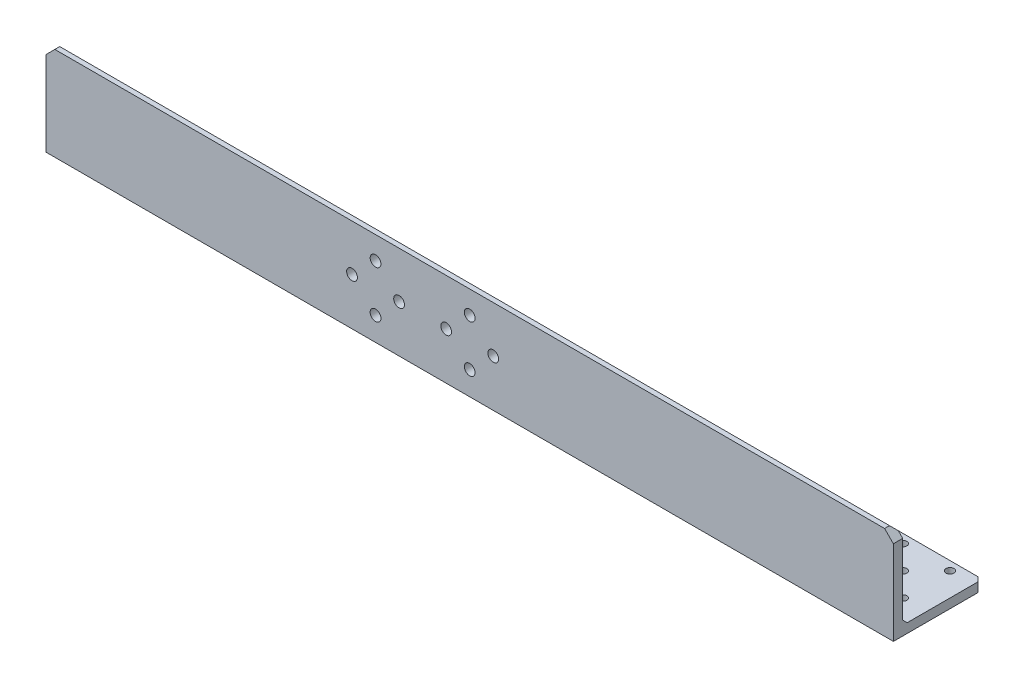
ISO-10303-21;
HEADER;
FILE_DESCRIPTION(('STEP AP214'),'2;1');
FILE_NAME('part.step','',(''),(''),'','','');
FILE_SCHEMA(('AUTOMOTIVE_DESIGN { 1 0 10303 214 1 1 1 1 }'));
ENDSEC;
DATA;
#1=APPLICATION_CONTEXT('core data for automotive mechanical design processes');
#2=APPLICATION_PROTOCOL_DEFINITION('international standard','automotive_design',2000,#1);
#3=PRODUCT_CONTEXT('',#1,'mechanical');
#4=PRODUCT('Part','Part','',(#3));
#5=PRODUCT_RELATED_PRODUCT_CATEGORY('part','',(#4));
#6=PRODUCT_DEFINITION_FORMATION('','',#4);
#7=PRODUCT_DEFINITION_CONTEXT('part definition',#1,'design');
#8=PRODUCT_DEFINITION('design','',#6,#7);
#9=PRODUCT_DEFINITION_SHAPE('','',#8);
#10=(LENGTH_UNIT() NAMED_UNIT(*) SI_UNIT(.MILLI.,.METRE.));
#11=(NAMED_UNIT(*) PLANE_ANGLE_UNIT() SI_UNIT($,.RADIAN.));
#12=(NAMED_UNIT(*) SI_UNIT($,.STERADIAN.) SOLID_ANGLE_UNIT());
#13=UNCERTAINTY_MEASURE_WITH_UNIT(LENGTH_MEASURE(1.E-05),#10,'distance_accuracy_value','');
#14=(GEOMETRIC_REPRESENTATION_CONTEXT(3) GLOBAL_UNCERTAINTY_ASSIGNED_CONTEXT((#13)) GLOBAL_UNIT_ASSIGNED_CONTEXT((#10,
#11,#12)) REPRESENTATION_CONTEXT('',''));
#15=CARTESIAN_POINT('',(0.,0.,0.));
#16=DIRECTION('',(0.,0.,1.));
#17=DIRECTION('',(1.,0.,0.));
#18=AXIS2_PLACEMENT_3D('',#15,#16,#17);
#19=CARTESIAN_POINT('',(144.,31.75,-3.175));
#20=DIRECTION('',(0.,0.,1.));
#21=DIRECTION('',(0.,-1.,0.));
#22=AXIS2_PLACEMENT_3D('',#19,#20,#21);
#23=PLANE('',#22);
#24=CARTESIAN_POINT('',(8.00000000000005,16.,-3.17500000000001));
#25=DIRECTION('',(0.,0.,-1.));
#26=DIRECTION('',(0.,1.,0.));
#27=AXIS2_PLACEMENT_3D('',#24,#25,#26);
#28=CIRCLE('',#27,1.8288);
#29=CARTESIAN_POINT('',(8.00000000000005,17.8288,-3.175));
#30=VERTEX_POINT('',#29);
#31=EDGE_CURVE('E435',#30,#30,#28,.T.);
#32=ORIENTED_EDGE('',*,*,#31,.F.);
#33=EDGE_LOOP('',(#32));
#34=FACE_BOUND('',#33,.T.);
#35=CARTESIAN_POINT('',(-7.99999999999996,16.,-3.17500000000001));
#36=DIRECTION('',(0.,0.,-1.));
#37=DIRECTION('',(0.,1.,0.));
#38=AXIS2_PLACEMENT_3D('',#35,#36,#37);
#39=CIRCLE('',#38,1.8288);
#40=CARTESIAN_POINT('',(-7.99999999999996,17.8288,-3.175));
#41=VERTEX_POINT('',#40);
#42=EDGE_CURVE('E429',#41,#41,#39,.T.);
#43=ORIENTED_EDGE('',*,*,#42,.F.);
#44=EDGE_LOOP('',(#43));
#45=FACE_BOUND('',#44,.T.);
#46=CARTESIAN_POINT('',(0.,7.99999999999999,-3.17500000000001));
#47=DIRECTION('',(0.,0.,-1.));
#48=DIRECTION('',(0.,1.,0.));
#49=AXIS2_PLACEMENT_3D('',#46,#47,#48);
#50=CIRCLE('',#49,1.8288);
#51=CARTESIAN_POINT('',(0.,9.82879999999999,-3.17500000000001));
#52=VERTEX_POINT('',#51);
#53=EDGE_CURVE('E423',#52,#52,#50,.T.);
#54=ORIENTED_EDGE('',*,*,#53,.F.);
#55=EDGE_LOOP('',(#54));
#56=FACE_BOUND('',#55,.T.);
#57=CARTESIAN_POINT('',(-24.,16.,-3.17500000000001));
#58=DIRECTION('',(0.,0.,-1.));
#59=DIRECTION('',(0.,1.,0.));
#60=AXIS2_PLACEMENT_3D('',#57,#58,#59);
#61=CIRCLE('',#60,1.8288);
#62=CARTESIAN_POINT('',(-24.,17.8288,-3.175));
#63=VERTEX_POINT('',#62);
#64=EDGE_CURVE('E417',#63,#63,#61,.T.);
#65=ORIENTED_EDGE('',*,*,#64,.F.);
#66=EDGE_LOOP('',(#65));
#67=FACE_BOUND('',#66,.T.);
#68=CARTESIAN_POINT('',(-32.,24.,-3.175));
#69=DIRECTION('',(0.,0.,-1.));
#70=DIRECTION('',(0.,1.,0.));
#71=AXIS2_PLACEMENT_3D('',#68,#69,#70);
#72=CIRCLE('',#71,1.8288);
#73=CARTESIAN_POINT('',(-32.,25.8288,-3.175));
#74=VERTEX_POINT('',#73);
#75=EDGE_CURVE('E411',#74,#74,#72,.T.);
#76=ORIENTED_EDGE('',*,*,#75,.F.);
#77=EDGE_LOOP('',(#76));
#78=FACE_BOUND('',#77,.T.);
#79=CARTESIAN_POINT('',(-40.,16.,-3.17500000000001));
#80=DIRECTION('',(0.,0.,-1.));
#81=DIRECTION('',(0.,1.,0.));
#82=AXIS2_PLACEMENT_3D('',#79,#80,#81);
#83=CIRCLE('',#82,1.8288);
#84=CARTESIAN_POINT('',(-40.,17.8288,-3.175));
#85=VERTEX_POINT('',#84);
#86=EDGE_CURVE('E405',#85,#85,#83,.T.);
#87=ORIENTED_EDGE('',*,*,#86,.F.);
#88=EDGE_LOOP('',(#87));
#89=FACE_BOUND('',#88,.T.);
#90=CARTESIAN_POINT('',(-32.,7.99999999999999,-3.17500000000001));
#91=DIRECTION('',(0.,0.,-1.));
#92=DIRECTION('',(0.,1.,0.));
#93=AXIS2_PLACEMENT_3D('',#90,#91,#92);
#94=CIRCLE('',#93,1.8288);
#95=CARTESIAN_POINT('',(-32.,9.82879999999999,-3.17500000000001));
#96=VERTEX_POINT('',#95);
#97=EDGE_CURVE('E399',#96,#96,#94,.T.);
#98=ORIENTED_EDGE('',*,*,#97,.F.);
#99=EDGE_LOOP('',(#98));
#100=FACE_BOUND('',#99,.T.);
#101=DIRECTION('',(0.,1.,0.));
#102=VECTOR('',#101,1.);
#103=CARTESIAN_POINT('',(-144.,31.75,-3.175));
#104=LINE('',#103,#102);
#105=CARTESIAN_POINT('',(-144.,4.67500000000004,-3.17500000000001));
#106=VERTEX_POINT('',#105);
#107=CARTESIAN_POINT('',(-144.,28.75,-3.175));
#108=VERTEX_POINT('',#107);
#109=EDGE_CURVE('E152',#106,#108,#104,.T.);
#110=ORIENTED_EDGE('',*,*,#109,.T.);
#111=DIRECTION('',(0.707106781186551,0.707106781186544,0.));
#112=VECTOR('',#111,1.);
#113=CARTESIAN_POINT('',(-141.,31.75,-3.175));
#114=LINE('',#113,#112);
#115=CARTESIAN_POINT('',(-142.5,30.25,-3.175));
#116=VERTEX_POINT('',#115);
#117=EDGE_CURVE('E210',#108,#116,#114,.T.);
#118=ORIENTED_EDGE('',*,*,#117,.T.);
#119=DIRECTION('',(1.,0.,0.));
#120=VECTOR('',#119,1.);
#121=CARTESIAN_POINT('',(144.,30.25,-3.175));
#122=LINE('',#121,#120);
#123=CARTESIAN_POINT('',(142.5,30.25,-3.175));
#124=VERTEX_POINT('',#123);
#125=EDGE_CURVE('E181',#116,#124,#122,.T.);
#126=ORIENTED_EDGE('',*,*,#125,.T.);
#127=DIRECTION('',(-0.707106781186548,0.707106781186548,0.));
#128=VECTOR('',#127,1.);
#129=CARTESIAN_POINT('',(144.,28.75,-3.175));
#130=LINE('',#129,#128);
#131=CARTESIAN_POINT('',(144.,28.75,-3.175));
#132=VERTEX_POINT('',#131);
#133=EDGE_CURVE('E208',#124,#132,#130,.F.);
#134=ORIENTED_EDGE('',*,*,#133,.T.);
#135=DIRECTION('',(0.,1.,0.));
#136=VECTOR('',#135,1.);
#137=CARTESIAN_POINT('',(144.,31.75,-3.175));
#138=LINE('',#137,#136);
#139=CARTESIAN_POINT('',(144.,4.67500000000004,-3.17500000000001));
#140=VERTEX_POINT('',#139);
#141=EDGE_CURVE('E250',#140,#132,#138,.T.);
#142=ORIENTED_EDGE('',*,*,#141,.F.);
#143=DIRECTION('',(-1.,0.,0.));
#144=VECTOR('',#143,1.);
#145=CARTESIAN_POINT('',(-144.,4.67500000000004,-3.17500000000001));
#146=LINE('',#145,#144);
#147=EDGE_CURVE('E184',#140,#106,#146,.T.);
#148=ORIENTED_EDGE('',*,*,#147,.T.);
#149=EDGE_LOOP('',(#110,#118,#126,#134,#142,#148));
#150=FACE_BOUND('',#149,.T.);
#151=CARTESIAN_POINT('',(0.,24.,-3.175));
#152=DIRECTION('',(0.,0.,-1.));
#153=DIRECTION('',(0.,1.,0.));
#154=AXIS2_PLACEMENT_3D('',#151,#152,#153);
#155=CIRCLE('',#154,1.8288);
#156=CARTESIAN_POINT('',(0.,25.8288,-3.175));
#157=VERTEX_POINT('',#156);
#158=EDGE_CURVE('E441',#157,#157,#155,.T.);
#159=ORIENTED_EDGE('',*,*,#158,.F.);
#160=EDGE_LOOP('',(#159));
#161=FACE_BOUND('',#160,.T.);
#162=ADVANCED_FACE('F48',(#34,#45,#56,#67,#78,#89,#100,#150,#161),#23,.F.);
#163=CARTESIAN_POINT('',(144.,0.,0.));
#164=DIRECTION('',(0.,0.,-1.));
#165=DIRECTION('',(-1.,0.,0.));
#166=AXIS2_PLACEMENT_3D('',#163,#164,#165);
#167=PLANE('',#166);
#168=CARTESIAN_POINT('',(0.,24.,0.));
#169=DIRECTION('',(0.,0.,-1.));
#170=DIRECTION('',(0.,1.,0.));
#171=AXIS2_PLACEMENT_3D('',#168,#169,#170);
#172=CIRCLE('',#171,1.8288);
#173=CARTESIAN_POINT('',(0.,25.8288,0.));
#174=VERTEX_POINT('',#173);
#175=EDGE_CURVE('E438',#174,#174,#172,.T.);
#176=ORIENTED_EDGE('',*,*,#175,.T.);
#177=EDGE_LOOP('',(#176));
#178=FACE_BOUND('',#177,.T.);
#179=CARTESIAN_POINT('',(8.00000000000005,16.,0.));
#180=DIRECTION('',(0.,0.,-1.));
#181=DIRECTION('',(0.,1.,0.));
#182=AXIS2_PLACEMENT_3D('',#179,#180,#181);
#183=CIRCLE('',#182,1.8288);
#184=CARTESIAN_POINT('',(8.00000000000005,17.8288,0.));
#185=VERTEX_POINT('',#184);
#186=EDGE_CURVE('E432',#185,#185,#183,.T.);
#187=ORIENTED_EDGE('',*,*,#186,.T.);
#188=EDGE_LOOP('',(#187));
#189=FACE_BOUND('',#188,.T.);
#190=CARTESIAN_POINT('',(-7.99999999999996,16.,0.));
#191=DIRECTION('',(0.,0.,-1.));
#192=DIRECTION('',(0.,1.,0.));
#193=AXIS2_PLACEMENT_3D('',#190,#191,#192);
#194=CIRCLE('',#193,1.8288);
#195=CARTESIAN_POINT('',(-7.99999999999996,17.8288,0.));
#196=VERTEX_POINT('',#195);
#197=EDGE_CURVE('E426',#196,#196,#194,.T.);
#198=ORIENTED_EDGE('',*,*,#197,.T.);
#199=EDGE_LOOP('',(#198));
#200=FACE_BOUND('',#199,.T.);
#201=CARTESIAN_POINT('',(0.,7.99999999999999,0.));
#202=DIRECTION('',(0.,0.,-1.));
#203=DIRECTION('',(0.,1.,0.));
#204=AXIS2_PLACEMENT_3D('',#201,#202,#203);
#205=CIRCLE('',#204,1.8288);
#206=CARTESIAN_POINT('',(0.,9.82879999999999,0.));
#207=VERTEX_POINT('',#206);
#208=EDGE_CURVE('E420',#207,#207,#205,.T.);
#209=ORIENTED_EDGE('',*,*,#208,.T.);
#210=EDGE_LOOP('',(#209));
#211=FACE_BOUND('',#210,.T.);
#212=CARTESIAN_POINT('',(-24.,16.,0.));
#213=DIRECTION('',(0.,0.,-1.));
#214=DIRECTION('',(0.,1.,0.));
#215=AXIS2_PLACEMENT_3D('',#212,#213,#214);
#216=CIRCLE('',#215,1.8288);
#217=CARTESIAN_POINT('',(-24.,17.8288,0.));
#218=VERTEX_POINT('',#217);
#219=EDGE_CURVE('E414',#218,#218,#216,.T.);
#220=ORIENTED_EDGE('',*,*,#219,.T.);
#221=EDGE_LOOP('',(#220));
#222=FACE_BOUND('',#221,.T.);
#223=CARTESIAN_POINT('',(-32.,24.,0.));
#224=DIRECTION('',(0.,0.,-1.));
#225=DIRECTION('',(0.,1.,0.));
#226=AXIS2_PLACEMENT_3D('',#223,#224,#225);
#227=CIRCLE('',#226,1.8288);
#228=CARTESIAN_POINT('',(-32.,25.8288,0.));
#229=VERTEX_POINT('',#228);
#230=EDGE_CURVE('E408',#229,#229,#227,.T.);
#231=ORIENTED_EDGE('',*,*,#230,.T.);
#232=EDGE_LOOP('',(#231));
#233=FACE_BOUND('',#232,.T.);
#234=CARTESIAN_POINT('',(-40.,16.,0.));
#235=DIRECTION('',(0.,0.,-1.));
#236=DIRECTION('',(0.,1.,0.));
#237=AXIS2_PLACEMENT_3D('',#234,#235,#236);
#238=CIRCLE('',#237,1.8288);
#239=CARTESIAN_POINT('',(-40.,17.8288,0.));
#240=VERTEX_POINT('',#239);
#241=EDGE_CURVE('E402',#240,#240,#238,.T.);
#242=ORIENTED_EDGE('',*,*,#241,.T.);
#243=EDGE_LOOP('',(#242));
#244=FACE_BOUND('',#243,.T.);
#245=CARTESIAN_POINT('',(-32.,7.99999999999999,0.));
#246=DIRECTION('',(0.,0.,-1.));
#247=DIRECTION('',(0.,1.,0.));
#248=AXIS2_PLACEMENT_3D('',#245,#246,#247);
#249=CIRCLE('',#248,1.8288);
#250=CARTESIAN_POINT('',(-32.,9.82879999999999,0.));
#251=VERTEX_POINT('',#250);
#252=EDGE_CURVE('E396',#251,#251,#249,.T.);
#253=ORIENTED_EDGE('',*,*,#252,.T.);
#254=EDGE_LOOP('',(#253));
#255=FACE_BOUND('',#254,.T.);
#256=DIRECTION('',(-1.,0.,0.));
#257=VECTOR('',#256,1.);
#258=CARTESIAN_POINT('',(144.,31.75,0.));
#259=LINE('',#258,#257);
#260=CARTESIAN_POINT('',(141.,31.75,0.));
#261=VERTEX_POINT('',#260);
#262=CARTESIAN_POINT('',(-141.,31.75,0.));
#263=VERTEX_POINT('',#262);
#264=EDGE_CURVE('E172',#261,#263,#259,.T.);
#265=ORIENTED_EDGE('',*,*,#264,.T.);
#266=DIRECTION('',(-0.707106781186551,-0.707106781186544,0.));
#267=VECTOR('',#266,1.);
#268=CARTESIAN_POINT('',(-141.,31.75,0.));
#269=LINE('',#268,#267);
#270=CARTESIAN_POINT('',(-144.,28.75,0.));
#271=VERTEX_POINT('',#270);
#272=EDGE_CURVE('E202',#263,#271,#269,.T.);
#273=ORIENTED_EDGE('',*,*,#272,.T.);
#274=DIRECTION('',(0.,-1.,0.));
#275=VECTOR('',#274,1.);
#276=CARTESIAN_POINT('',(-144.,0.,0.));
#277=LINE('',#276,#275);
#278=CARTESIAN_POINT('',(-144.,0.,0.));
#279=VERTEX_POINT('',#278);
#280=EDGE_CURVE('E163',#271,#279,#277,.T.);
#281=ORIENTED_EDGE('',*,*,#280,.T.);
#282=DIRECTION('',(-1.,0.,0.));
#283=VECTOR('',#282,1.);
#284=CARTESIAN_POINT('',(144.,0.,0.));
#285=LINE('',#284,#283);
#286=CARTESIAN_POINT('',(144.,0.,0.));
#287=VERTEX_POINT('',#286);
#288=EDGE_CURVE('E157',#287,#279,#285,.T.);
#289=ORIENTED_EDGE('',*,*,#288,.F.);
#290=DIRECTION('',(0.,-1.,0.));
#291=VECTOR('',#290,1.);
#292=CARTESIAN_POINT('',(144.,0.,0.));
#293=LINE('',#292,#291);
#294=CARTESIAN_POINT('',(144.,28.75,0.));
#295=VERTEX_POINT('',#294);
#296=EDGE_CURVE('E145',#295,#287,#293,.T.);
#297=ORIENTED_EDGE('',*,*,#296,.F.);
#298=DIRECTION('',(0.707106781186548,-0.707106781186548,0.));
#299=VECTOR('',#298,1.);
#300=CARTESIAN_POINT('',(144.,28.75,0.));
#301=LINE('',#300,#299);
#302=EDGE_CURVE('E200',#295,#261,#301,.F.);
#303=ORIENTED_EDGE('',*,*,#302,.T.);
#304=EDGE_LOOP('',(#265,#273,#281,#289,#297,#303));
#305=FACE_BOUND('',#304,.T.);
#306=ADVANCED_FACE('F161',(#178,#189,#200,#211,#222,#233,#244,#255,#305),#167,.F.);
#307=CARTESIAN_POINT('',(144.,0.,0.));
#308=DIRECTION('',(0.,1.,0.));
#309=DIRECTION('',(0.,0.,1.));
#310=AXIS2_PLACEMENT_3D('',#307,#308,#309);
#311=PLANE('',#310);
#312=CARTESIAN_POINT('',(-136.,0.,-27.221));
#313=DIRECTION('',(0.,1.,0.));
#314=DIRECTION('',(0.,0.,1.));
#315=AXIS2_PLACEMENT_3D('',#312,#313,#314);
#316=CIRCLE('',#315,1.35255000000001);
#317=CARTESIAN_POINT('',(-136.,0.,-25.86845));
#318=VERTEX_POINT('',#317);
#319=EDGE_CURVE('E319',#318,#318,#316,.T.);
#320=ORIENTED_EDGE('',*,*,#319,.T.);
#321=EDGE_LOOP('',(#320));
#322=FACE_BOUND('',#321,.T.);
#323=CARTESIAN_POINT('',(-120.,0.,-27.221));
#324=DIRECTION('',(0.,1.,0.));
#325=DIRECTION('',(0.,0.,1.));
#326=AXIS2_PLACEMENT_3D('',#323,#324,#325);
#327=CIRCLE('',#326,1.35254999999999);
#328=CARTESIAN_POINT('',(-120.,0.,-25.86845));
#329=VERTEX_POINT('',#328);
#330=EDGE_CURVE('E323',#329,#329,#327,.T.);
#331=ORIENTED_EDGE('',*,*,#330,.T.);
#332=EDGE_LOOP('',(#331));
#333=FACE_BOUND('',#332,.T.);
#334=CARTESIAN_POINT('',(-128.,0.,-19.221));
#335=DIRECTION('',(0.,1.,0.));
#336=DIRECTION('',(0.,0.,1.));
#337=AXIS2_PLACEMENT_3D('',#334,#335,#336);
#338=CIRCLE('',#337,1.35255000000001);
#339=CARTESIAN_POINT('',(-128.,0.,-17.86845));
#340=VERTEX_POINT('',#339);
#341=EDGE_CURVE('E327',#340,#340,#338,.T.);
#342=ORIENTED_EDGE('',*,*,#341,.T.);
#343=EDGE_LOOP('',(#342));
#344=FACE_BOUND('',#343,.T.);
#345=CARTESIAN_POINT('',(-136.,0.,-11.221));
#346=DIRECTION('',(0.,1.,0.));
#347=DIRECTION('',(0.,0.,1.));
#348=AXIS2_PLACEMENT_3D('',#345,#346,#347);
#349=CIRCLE('',#348,1.35255000000001);
#350=CARTESIAN_POINT('',(-136.,0.,-9.86844999999996));
#351=VERTEX_POINT('',#350);
#352=EDGE_CURVE('E331',#351,#351,#349,.T.);
#353=ORIENTED_EDGE('',*,*,#352,.T.);
#354=EDGE_LOOP('',(#353));
#355=FACE_BOUND('',#354,.T.);
#356=CARTESIAN_POINT('',(-120.,0.,-11.221));
#357=DIRECTION('',(0.,1.,0.));
#358=DIRECTION('',(0.,0.,1.));
#359=AXIS2_PLACEMENT_3D('',#356,#357,#358);
#360=CIRCLE('',#359,1.35254999999999);
#361=CARTESIAN_POINT('',(-120.,0.,-9.86844999999997));
#362=VERTEX_POINT('',#361);
#363=EDGE_CURVE('E335',#362,#362,#360,.T.);
#364=ORIENTED_EDGE('',*,*,#363,.T.);
#365=EDGE_LOOP('',(#364));
#366=FACE_BOUND('',#365,.T.);
#367=CARTESIAN_POINT('',(120.,0.,-27.221));
#368=DIRECTION('',(0.,1.,0.));
#369=DIRECTION('',(0.,0.,1.));
#370=AXIS2_PLACEMENT_3D('',#367,#368,#369);
#371=CIRCLE('',#370,1.35254999999999);
#372=CARTESIAN_POINT('',(120.,0.,-25.86845));
#373=VERTEX_POINT('',#372);
#374=EDGE_CURVE('E339',#373,#373,#371,.T.);
#375=ORIENTED_EDGE('',*,*,#374,.T.);
#376=EDGE_LOOP('',(#375));
#377=FACE_BOUND('',#376,.T.);
#378=CARTESIAN_POINT('',(136.,0.,-27.221));
#379=DIRECTION('',(0.,1.,0.));
#380=DIRECTION('',(0.,0.,1.));
#381=AXIS2_PLACEMENT_3D('',#378,#379,#380);
#382=CIRCLE('',#381,1.35255000000001);
#383=CARTESIAN_POINT('',(136.,0.,-25.86845));
#384=VERTEX_POINT('',#383);
#385=EDGE_CURVE('E343',#384,#384,#382,.T.);
#386=ORIENTED_EDGE('',*,*,#385,.T.);
#387=EDGE_LOOP('',(#386));
#388=FACE_BOUND('',#387,.T.);
#389=CARTESIAN_POINT('',(128.,0.,-19.221));
#390=DIRECTION('',(0.,1.,0.));
#391=DIRECTION('',(0.,0.,1.));
#392=AXIS2_PLACEMENT_3D('',#389,#390,#391);
#393=CIRCLE('',#392,1.35255000000001);
#394=CARTESIAN_POINT('',(128.,0.,-17.86845));
#395=VERTEX_POINT('',#394);
#396=EDGE_CURVE('E347',#395,#395,#393,.T.);
#397=ORIENTED_EDGE('',*,*,#396,.T.);
#398=EDGE_LOOP('',(#397));
#399=FACE_BOUND('',#398,.T.);
#400=CARTESIAN_POINT('',(120.,0.,-11.221));
#401=DIRECTION('',(0.,1.,0.));
#402=DIRECTION('',(0.,0.,1.));
#403=AXIS2_PLACEMENT_3D('',#400,#401,#402);
#404=CIRCLE('',#403,1.35254999999999);
#405=CARTESIAN_POINT('',(120.,0.,-9.86844999999997));
#406=VERTEX_POINT('',#405);
#407=EDGE_CURVE('E351',#406,#406,#404,.T.);
#408=ORIENTED_EDGE('',*,*,#407,.T.);
#409=EDGE_LOOP('',(#408));
#410=FACE_BOUND('',#409,.T.);
#411=CARTESIAN_POINT('',(136.,0.,-11.221));
#412=DIRECTION('',(0.,1.,0.));
#413=DIRECTION('',(0.,0.,1.));
#414=AXIS2_PLACEMENT_3D('',#411,#412,#413);
#415=CIRCLE('',#414,1.35255000000001);
#416=CARTESIAN_POINT('',(136.,0.,-9.86844999999996));
#417=VERTEX_POINT('',#416);
#418=EDGE_CURVE('E255',#417,#417,#415,.T.);
#419=ORIENTED_EDGE('',*,*,#418,.T.);
#420=EDGE_LOOP('',(#419));
#421=FACE_BOUND('',#420,.T.);
#422=DIRECTION('',(0.,0.,-1.));
#423=VECTOR('',#422,1.);
#424=CARTESIAN_POINT('',(-144.,0.,0.));
#425=LINE('',#424,#423);
#426=CARTESIAN_POINT('',(-144.,0.,-28.75));
#427=VERTEX_POINT('',#426);
#428=EDGE_CURVE('E231',#279,#427,#425,.T.);
#429=ORIENTED_EDGE('',*,*,#428,.T.);
#430=DIRECTION('',(0.707106781186551,0.,-0.707106781186544));
#431=VECTOR('',#430,1.);
#432=CARTESIAN_POINT('',(-141.,0.,-31.75));
#433=LINE('',#432,#431);
#434=CARTESIAN_POINT('',(-141.,0.,-31.75));
#435=VERTEX_POINT('',#434);
#436=EDGE_CURVE('E229',#427,#435,#433,.T.);
#437=ORIENTED_EDGE('',*,*,#436,.T.);
#438=DIRECTION('',(-1.,0.,0.));
#439=VECTOR('',#438,1.);
#440=CARTESIAN_POINT('',(144.,0.,-31.75));
#441=LINE('',#440,#439);
#442=CARTESIAN_POINT('',(141.,0.,-31.75));
#443=VERTEX_POINT('',#442);
#444=EDGE_CURVE('E166',#443,#435,#441,.T.);
#445=ORIENTED_EDGE('',*,*,#444,.F.);
#446=DIRECTION('',(-0.707106781186548,0.,-0.707106781186548));
#447=VECTOR('',#446,1.);
#448=CARTESIAN_POINT('',(144.,0.,-28.75));
#449=LINE('',#448,#447);
#450=CARTESIAN_POINT('',(144.,0.,-28.75));
#451=VERTEX_POINT('',#450);
#452=EDGE_CURVE('E63',#443,#451,#449,.F.);
#453=ORIENTED_EDGE('',*,*,#452,.T.);
#454=DIRECTION('',(0.,0.,-1.));
#455=VECTOR('',#454,1.);
#456=CARTESIAN_POINT('',(144.,0.,0.));
#457=LINE('',#456,#455);
#458=EDGE_CURVE('E147',#287,#451,#457,.T.);
#459=ORIENTED_EDGE('',*,*,#458,.F.);
#460=ORIENTED_EDGE('',*,*,#288,.T.);
#461=EDGE_LOOP('',(#429,#437,#445,#453,#459,#460));
#462=FACE_BOUND('',#461,.T.);
#463=ADVANCED_FACE('F156',(#322,#333,#344,#355,#366,#377,#388,#399,#410,#421,#462),#311,.F.);
#464=CARTESIAN_POINT('',(144.,0.,-31.75));
#465=DIRECTION('',(0.,0.,1.));
#466=DIRECTION('',(1.,0.,0.));
#467=AXIS2_PLACEMENT_3D('',#464,#465,#466);
#468=PLANE('',#467);
#469=ORIENTED_EDGE('',*,*,#444,.T.);
#470=DIRECTION('',(0.,1.,0.));
#471=VECTOR('',#470,1.);
#472=CARTESIAN_POINT('',(-141.,1.67500000000002,-31.75));
#473=LINE('',#472,#471);
#474=CARTESIAN_POINT('',(-141.,1.67500000000002,-31.75));
#475=VERTEX_POINT('',#474);
#476=EDGE_CURVE('E218',#435,#475,#473,.T.);
#477=ORIENTED_EDGE('',*,*,#476,.T.);
#478=DIRECTION('',(1.,0.,0.));
#479=VECTOR('',#478,1.);
#480=CARTESIAN_POINT('',(144.,1.67500000000002,-31.75));
#481=LINE('',#480,#479);
#482=CARTESIAN_POINT('',(141.,1.67500000000002,-31.75));
#483=VERTEX_POINT('',#482);
#484=EDGE_CURVE('E178',#475,#483,#481,.T.);
#485=ORIENTED_EDGE('',*,*,#484,.T.);
#486=DIRECTION('',(0.,-1.,0.));
#487=VECTOR('',#486,1.);
#488=CARTESIAN_POINT('',(141.,0.,-31.75));
#489=LINE('',#488,#487);
#490=EDGE_CURVE('E216',#483,#443,#489,.T.);
#491=ORIENTED_EDGE('',*,*,#490,.T.);
#492=EDGE_LOOP('',(#469,#477,#485,#491));
#493=FACE_BOUND('',#492,.T.);
#494=ADVANCED_FACE('F236',(#493),#468,.F.);
#495=CARTESIAN_POINT('',(144.,3.175,-31.75));
#496=DIRECTION('',(0.,-1.,0.));
#497=DIRECTION('',(0.,0.,-1.));
#498=AXIS2_PLACEMENT_3D('',#495,#496,#497);
#499=PLANE('',#498);
#500=CARTESIAN_POINT('',(-136.,3.175,-27.221));
#501=DIRECTION('',(0.,1.,0.));
#502=DIRECTION('',(0.,0.,1.));
#503=AXIS2_PLACEMENT_3D('',#500,#501,#502);
#504=CIRCLE('',#503,1.35254999999998);
#505=CARTESIAN_POINT('',(-136.,3.175,-25.86845));
#506=VERTEX_POINT('',#505);
#507=EDGE_CURVE('E393',#506,#506,#504,.T.);
#508=ORIENTED_EDGE('',*,*,#507,.F.);
#509=EDGE_LOOP('',(#508));
#510=FACE_BOUND('',#509,.T.);
#511=CARTESIAN_POINT('',(-120.,3.175,-27.221));
#512=DIRECTION('',(0.,1.,0.));
#513=DIRECTION('',(0.,0.,1.));
#514=AXIS2_PLACEMENT_3D('',#511,#512,#513);
#515=CIRCLE('',#514,1.35254999999999);
#516=CARTESIAN_POINT('',(-120.,3.175,-25.86845));
#517=VERTEX_POINT('',#516);
#518=EDGE_CURVE('E389',#517,#517,#515,.T.);
#519=ORIENTED_EDGE('',*,*,#518,.F.);
#520=EDGE_LOOP('',(#519));
#521=FACE_BOUND('',#520,.T.);
#522=CARTESIAN_POINT('',(-128.,3.17499999999999,-19.221));
#523=DIRECTION('',(0.,1.,0.));
#524=DIRECTION('',(0.,0.,1.));
#525=AXIS2_PLACEMENT_3D('',#522,#523,#524);
#526=CIRCLE('',#525,1.35254999999998);
#527=CARTESIAN_POINT('',(-128.,3.17499999999999,-17.86845));
#528=VERTEX_POINT('',#527);
#529=EDGE_CURVE('E385',#528,#528,#526,.T.);
#530=ORIENTED_EDGE('',*,*,#529,.F.);
#531=EDGE_LOOP('',(#530));
#532=FACE_BOUND('',#531,.T.);
#533=CARTESIAN_POINT('',(-136.,3.17499999999999,-11.221));
#534=DIRECTION('',(0.,1.,0.));
#535=DIRECTION('',(0.,0.,1.));
#536=AXIS2_PLACEMENT_3D('',#533,#534,#535);
#537=CIRCLE('',#536,1.35254999999998);
#538=CARTESIAN_POINT('',(-136.,3.17499999999999,-9.86844999999999));
#539=VERTEX_POINT('',#538);
#540=EDGE_CURVE('E381',#539,#539,#537,.T.);
#541=ORIENTED_EDGE('',*,*,#540,.F.);
#542=EDGE_LOOP('',(#541));
#543=FACE_BOUND('',#542,.T.);
#544=CARTESIAN_POINT('',(-120.,3.17499999999999,-11.221));
#545=DIRECTION('',(0.,1.,0.));
#546=DIRECTION('',(0.,0.,1.));
#547=AXIS2_PLACEMENT_3D('',#544,#545,#546);
#548=CIRCLE('',#547,1.35254999999999);
#549=CARTESIAN_POINT('',(-120.,3.17499999999999,-9.86844999999997));
#550=VERTEX_POINT('',#549);
#551=EDGE_CURVE('E377',#550,#550,#548,.T.);
#552=ORIENTED_EDGE('',*,*,#551,.F.);
#553=EDGE_LOOP('',(#552));
#554=FACE_BOUND('',#553,.T.);
#555=CARTESIAN_POINT('',(120.,3.175,-27.221));
#556=DIRECTION('',(0.,1.,0.));
#557=DIRECTION('',(0.,0.,1.));
#558=AXIS2_PLACEMENT_3D('',#555,#556,#557);
#559=CIRCLE('',#558,1.35254999999999);
#560=CARTESIAN_POINT('',(120.,3.175,-25.86845));
#561=VERTEX_POINT('',#560);
#562=EDGE_CURVE('E373',#561,#561,#559,.T.);
#563=ORIENTED_EDGE('',*,*,#562,.F.);
#564=EDGE_LOOP('',(#563));
#565=FACE_BOUND('',#564,.T.);
#566=CARTESIAN_POINT('',(136.,3.175,-27.221));
#567=DIRECTION('',(0.,1.,0.));
#568=DIRECTION('',(0.,0.,1.));
#569=AXIS2_PLACEMENT_3D('',#566,#567,#568);
#570=CIRCLE('',#569,1.35254999999998);
#571=CARTESIAN_POINT('',(136.,3.175,-25.86845));
#572=VERTEX_POINT('',#571);
#573=EDGE_CURVE('E369',#572,#572,#570,.T.);
#574=ORIENTED_EDGE('',*,*,#573,.F.);
#575=EDGE_LOOP('',(#574));
#576=FACE_BOUND('',#575,.T.);
#577=CARTESIAN_POINT('',(128.,3.17499999999999,-19.221));
#578=DIRECTION('',(0.,1.,0.));
#579=DIRECTION('',(0.,0.,1.));
#580=AXIS2_PLACEMENT_3D('',#577,#578,#579);
#581=CIRCLE('',#580,1.35254999999998);
#582=CARTESIAN_POINT('',(128.,3.17499999999999,-17.86845));
#583=VERTEX_POINT('',#582);
#584=EDGE_CURVE('E365',#583,#583,#581,.T.);
#585=ORIENTED_EDGE('',*,*,#584,.F.);
#586=EDGE_LOOP('',(#585));
#587=FACE_BOUND('',#586,.T.);
#588=CARTESIAN_POINT('',(120.,3.17499999999999,-11.221));
#589=DIRECTION('',(0.,1.,0.));
#590=DIRECTION('',(0.,0.,1.));
#591=AXIS2_PLACEMENT_3D('',#588,#589,#590);
#592=CIRCLE('',#591,1.35254999999999);
#593=CARTESIAN_POINT('',(120.,3.17499999999999,-9.86844999999997));
#594=VERTEX_POINT('',#593);
#595=EDGE_CURVE('E361',#594,#594,#592,.T.);
#596=ORIENTED_EDGE('',*,*,#595,.F.);
#597=EDGE_LOOP('',(#596));
#598=FACE_BOUND('',#597,.T.);
#599=CARTESIAN_POINT('',(136.,3.17499999999999,-11.221));
#600=DIRECTION('',(0.,1.,0.));
#601=DIRECTION('',(0.,0.,1.));
#602=AXIS2_PLACEMENT_3D('',#599,#600,#601);
#603=CIRCLE('',#602,1.35254999999998);
#604=CARTESIAN_POINT('',(136.,3.17499999999999,-9.86844999999999));
#605=VERTEX_POINT('',#604);
#606=EDGE_CURVE('E355',#605,#605,#603,.T.);
#607=ORIENTED_EDGE('',*,*,#606,.F.);
#608=EDGE_LOOP('',(#607));
#609=FACE_BOUND('',#608,.T.);
#610=DIRECTION('',(-1.,0.,0.));
#611=VECTOR('',#610,1.);
#612=CARTESIAN_POINT('',(144.,3.175,-30.25));
#613=LINE('',#612,#611);
#614=CARTESIAN_POINT('',(142.5,3.175,-30.25));
#615=VERTEX_POINT('',#614);
#616=CARTESIAN_POINT('',(-142.5,3.175,-30.25));
#617=VERTEX_POINT('',#616);
#618=EDGE_CURVE('E169',#615,#617,#613,.T.);
#619=ORIENTED_EDGE('',*,*,#618,.T.);
#620=DIRECTION('',(-0.707106781186551,0.,0.707106781186544));
#621=VECTOR('',#620,1.);
#622=CARTESIAN_POINT('',(-141.,3.175,-31.75));
#623=LINE('',#622,#621);
#624=CARTESIAN_POINT('',(-144.,3.175,-28.75));
#625=VERTEX_POINT('',#624);
#626=EDGE_CURVE('E226',#617,#625,#623,.T.);
#627=ORIENTED_EDGE('',*,*,#626,.T.);
#628=DIRECTION('',(0.,0.,1.));
#629=VECTOR('',#628,1.);
#630=CARTESIAN_POINT('',(-144.,3.175,-31.75));
#631=LINE('',#630,#629);
#632=CARTESIAN_POINT('',(-144.,3.17499999999998,-4.67500000000006));
#633=VERTEX_POINT('',#632);
#634=EDGE_CURVE('E257',#625,#633,#631,.T.);
#635=ORIENTED_EDGE('',*,*,#634,.T.);
#636=DIRECTION('',(1.,0.,0.));
#637=VECTOR('',#636,1.);
#638=CARTESIAN_POINT('',(144.,3.17499999999998,-4.67500000000006));
#639=LINE('',#638,#637);
#640=CARTESIAN_POINT('',(144.,3.17499999999998,-4.67500000000006));
#641=VERTEX_POINT('',#640);
#642=EDGE_CURVE('E165',#633,#641,#639,.T.);
#643=ORIENTED_EDGE('',*,*,#642,.T.);
#644=DIRECTION('',(0.,0.,1.));
#645=VECTOR('',#644,1.);
#646=CARTESIAN_POINT('',(144.,3.175,-31.75));
#647=LINE('',#646,#645);
#648=CARTESIAN_POINT('',(144.,3.175,-28.75));
#649=VERTEX_POINT('',#648);
#650=EDGE_CURVE('E158',#649,#641,#647,.T.);
#651=ORIENTED_EDGE('',*,*,#650,.F.);
#652=DIRECTION('',(0.707106781186548,0.,0.707106781186548));
#653=VECTOR('',#652,1.);
#654=CARTESIAN_POINT('',(144.,3.175,-28.75));
#655=LINE('',#654,#653);
#656=EDGE_CURVE('E71',#649,#615,#655,.F.);
#657=ORIENTED_EDGE('',*,*,#656,.T.);
#658=EDGE_LOOP('',(#619,#627,#635,#643,#651,#657));
#659=FACE_BOUND('',#658,.T.);
#660=ADVANCED_FACE('F245',(#510,#521,#532,#543,#554,#565,#576,#587,#598,#609,#659),#499,.F.);
#661=CARTESIAN_POINT('',(144.,31.75,0.));
#662=DIRECTION('',(0.,-1.,0.));
#663=DIRECTION('',(0.,0.,-1.));
#664=AXIS2_PLACEMENT_3D('',#661,#662,#663);
#665=PLANE('',#664);
#666=DIRECTION('',(-1.,0.,0.));
#667=VECTOR('',#666,1.);
#668=CARTESIAN_POINT('',(144.,31.75,-1.67499999999997));
#669=LINE('',#668,#667);
#670=CARTESIAN_POINT('',(141.,31.75,-1.67499999999997));
#671=VERTEX_POINT('',#670);
#672=CARTESIAN_POINT('',(-141.,31.75,-1.67499999999997));
#673=VERTEX_POINT('',#672);
#674=EDGE_CURVE('E187',#671,#673,#669,.T.);
#675=ORIENTED_EDGE('',*,*,#674,.T.);
#676=DIRECTION('',(0.,0.,1.));
#677=VECTOR('',#676,1.);
#678=CARTESIAN_POINT('',(-141.,31.75,0.));
#679=LINE('',#678,#677);
#680=EDGE_CURVE('E197',#673,#263,#679,.T.);
#681=ORIENTED_EDGE('',*,*,#680,.T.);
#682=ORIENTED_EDGE('',*,*,#264,.F.);
#683=DIRECTION('',(0.,0.,-1.));
#684=VECTOR('',#683,1.);
#685=CARTESIAN_POINT('',(141.,31.75,0.));
#686=LINE('',#685,#684);
#687=EDGE_CURVE('E195',#261,#671,#686,.T.);
#688=ORIENTED_EDGE('',*,*,#687,.T.);
#689=EDGE_LOOP('',(#675,#681,#682,#688));
#690=FACE_BOUND('',#689,.T.);
#691=ADVANCED_FACE('F263',(#690),#665,.F.);
#692=CARTESIAN_POINT('',(144.,0.,0.));
#693=DIRECTION('',(-1.,0.,0.));
#694=DIRECTION('',(0.,0.,1.));
#695=AXIS2_PLACEMENT_3D('',#692,#693,#694);
#696=PLANE('',#695);
#697=ORIENTED_EDGE('',*,*,#458,.T.);
#698=DIRECTION('',(0.,1.,0.));
#699=VECTOR('',#698,1.);
#700=CARTESIAN_POINT('',(144.,0.,-28.75));
#701=LINE('',#700,#699);
#702=EDGE_CURVE('E13',#451,#649,#701,.T.);
#703=ORIENTED_EDGE('',*,*,#702,.T.);
#704=ORIENTED_EDGE('',*,*,#650,.T.);
#705=DIRECTION('',(0.,-0.707106781186548,-0.707106781186547));
#706=VECTOR('',#705,1.);
#707=CARTESIAN_POINT('',(144.,3.92500000000002,-3.92500000000003));
#708=LINE('',#707,#706);
#709=EDGE_CURVE('E193',#641,#140,#708,.F.);
#710=ORIENTED_EDGE('',*,*,#709,.T.);
#711=ORIENTED_EDGE('',*,*,#141,.T.);
#712=DIRECTION('',(0.,0.,1.));
#713=VECTOR('',#712,1.);
#714=CARTESIAN_POINT('',(144.,28.75,0.));
#715=LINE('',#714,#713);
#716=EDGE_CURVE('E56',#132,#295,#715,.T.);
#717=ORIENTED_EDGE('',*,*,#716,.T.);
#718=ORIENTED_EDGE('',*,*,#296,.T.);
#719=EDGE_LOOP('',(#697,#703,#704,#710,#711,#717,#718));
#720=FACE_BOUND('',#719,.T.);
#721=ADVANCED_FACE('F146',(#720),#696,.F.);
#722=CARTESIAN_POINT('',(-144.,0.,0.));
#723=DIRECTION('',(-1.,0.,0.));
#724=DIRECTION('',(0.,0.,1.));
#725=AXIS2_PLACEMENT_3D('',#722,#723,#724);
#726=PLANE('',#725);
#727=ORIENTED_EDGE('',*,*,#280,.F.);
#728=DIRECTION('',(0.,0.,-1.));
#729=VECTOR('',#728,1.);
#730=CARTESIAN_POINT('',(-144.,28.75,-1.67499999999997));
#731=LINE('',#730,#729);
#732=EDGE_CURVE('E206',#271,#108,#731,.T.);
#733=ORIENTED_EDGE('',*,*,#732,.T.);
#734=ORIENTED_EDGE('',*,*,#109,.F.);
#735=DIRECTION('',(0.,0.707106781186548,0.707106781186547));
#736=VECTOR('',#735,1.);
#737=CARTESIAN_POINT('',(-144.,4.67500000000004,-3.17500000000001));
#738=LINE('',#737,#736);
#739=EDGE_CURVE('E190',#106,#633,#738,.F.);
#740=ORIENTED_EDGE('',*,*,#739,.T.);
#741=ORIENTED_EDGE('',*,*,#634,.F.);
#742=DIRECTION('',(0.,-1.,0.));
#743=VECTOR('',#742,1.);
#744=CARTESIAN_POINT('',(-144.,0.,-28.75));
#745=LINE('',#744,#743);
#746=EDGE_CURVE('E204',#625,#427,#745,.T.);
#747=ORIENTED_EDGE('',*,*,#746,.T.);
#748=ORIENTED_EDGE('',*,*,#428,.F.);
#749=EDGE_LOOP('',(#727,#733,#734,#740,#741,#747,#748));
#750=FACE_BOUND('',#749,.T.);
#751=ADVANCED_FACE('F282',(#750),#726,.T.);
#752=CARTESIAN_POINT('',(144.,3.175,-30.25));
#753=DIRECTION('',(0.,-0.707106781186548,0.707106781186547));
#754=DIRECTION('',(-1.,0.,0.));
#755=AXIS2_PLACEMENT_3D('',#752,#753,#754);
#756=PLANE('',#755);
#757=ORIENTED_EDGE('',*,*,#484,.F.);
#758=DIRECTION('',(0.577350269189629,-0.577350269189624,-0.577350269189624));
#759=VECTOR('',#758,1.);
#760=CARTESIAN_POINT('',(-46.9999999999988,-92.3250000000003,-125.75));
#761=LINE('',#760,#759);
#762=EDGE_CURVE('E223',#475,#617,#761,.F.);
#763=ORIENTED_EDGE('',*,*,#762,.T.);
#764=ORIENTED_EDGE('',*,*,#618,.F.);
#765=DIRECTION('',(-0.577350269189626,-0.577350269189626,-0.577350269189626));
#766=VECTOR('',#765,1.);
#767=CARTESIAN_POINT('',(143.,3.675,-29.75));
#768=LINE('',#767,#766);
#769=EDGE_CURVE('E221',#615,#483,#768,.T.);
#770=ORIENTED_EDGE('',*,*,#769,.T.);
#771=EDGE_LOOP('',(#757,#763,#764,#770));
#772=FACE_BOUND('',#771,.T.);
#773=ADVANCED_FACE('F243',(#772),#756,.F.);
#774=CARTESIAN_POINT('',(144.,4.67500000000004,-3.17500000000001));
#775=DIRECTION('',(0.,0.707106781186547,-0.707106781186548));
#776=DIRECTION('',(1.,0.,0.));
#777=AXIS2_PLACEMENT_3D('',#774,#775,#776);
#778=PLANE('',#777);
#779=ORIENTED_EDGE('',*,*,#709,.F.);
#780=ORIENTED_EDGE('',*,*,#642,.F.);
#781=ORIENTED_EDGE('',*,*,#739,.F.);
#782=ORIENTED_EDGE('',*,*,#147,.F.);
#783=EDGE_LOOP('',(#779,#780,#781,#782));
#784=FACE_BOUND('',#783,.T.);
#785=ADVANCED_FACE('F285',(#784),#778,.T.);
#786=CARTESIAN_POINT('',(144.,31.75,-1.67499999999997));
#787=DIRECTION('',(0.,-0.707106781186547,0.707106781186548));
#788=DIRECTION('',(-1.,0.,0.));
#789=AXIS2_PLACEMENT_3D('',#786,#787,#788);
#790=PLANE('',#789);
#791=ORIENTED_EDGE('',*,*,#125,.F.);
#792=DIRECTION('',(-0.577350269189629,-0.577350269189624,-0.577350269189624));
#793=VECTOR('',#792,1.);
#794=CARTESIAN_POINT('',(-45.9999999999988,126.75,93.3250000000003));
#795=LINE('',#794,#793);
#796=EDGE_CURVE('E214',#116,#673,#795,.F.);
#797=ORIENTED_EDGE('',*,*,#796,.T.);
#798=ORIENTED_EDGE('',*,*,#674,.F.);
#799=DIRECTION('',(0.577350269189626,-0.577350269189626,-0.577350269189626));
#800=VECTOR('',#799,1.);
#801=CARTESIAN_POINT('',(142.,30.75,-2.67499999999996));
#802=LINE('',#801,#800);
#803=EDGE_CURVE('E212',#671,#124,#802,.T.);
#804=ORIENTED_EDGE('',*,*,#803,.T.);
#805=EDGE_LOOP('',(#791,#797,#798,#804));
#806=FACE_BOUND('',#805,.T.);
#807=ADVANCED_FACE('F271',(#806),#790,.F.);
#808=CARTESIAN_POINT('',(-141.,31.75,0.));
#809=DIRECTION('',(-0.707106781186544,0.707106781186551,0.));
#810=DIRECTION('',(0.,0.,-1.));
#811=AXIS2_PLACEMENT_3D('',#808,#809,#810);
#812=PLANE('',#811);
#813=ORIENTED_EDGE('',*,*,#117,.F.);
#814=ORIENTED_EDGE('',*,*,#732,.F.);
#815=ORIENTED_EDGE('',*,*,#272,.F.);
#816=ORIENTED_EDGE('',*,*,#680,.F.);
#817=ORIENTED_EDGE('',*,*,#796,.F.);
#818=EDGE_LOOP('',(#813,#814,#815,#816,#817));
#819=FACE_BOUND('',#818,.T.);
#820=ADVANCED_FACE('F280',(#819),#812,.T.);
#821=CARTESIAN_POINT('',(-141.,0.,-31.75));
#822=DIRECTION('',(-0.707106781186544,0.,-0.707106781186551));
#823=DIRECTION('',(0.,-1.,0.));
#824=AXIS2_PLACEMENT_3D('',#821,#822,#823);
#825=PLANE('',#824);
#826=ORIENTED_EDGE('',*,*,#436,.F.);
#827=ORIENTED_EDGE('',*,*,#746,.F.);
#828=ORIENTED_EDGE('',*,*,#626,.F.);
#829=ORIENTED_EDGE('',*,*,#762,.F.);
#830=ORIENTED_EDGE('',*,*,#476,.F.);
#831=EDGE_LOOP('',(#826,#827,#828,#829,#830));
#832=FACE_BOUND('',#831,.T.);
#833=ADVANCED_FACE('F239',(#832),#825,.T.);
#834=CARTESIAN_POINT('',(144.,0.,-28.75));
#835=DIRECTION('',(-0.707106781186548,0.,0.707106781186548));
#836=DIRECTION('',(0.,1.,0.));
#837=AXIS2_PLACEMENT_3D('',#834,#835,#836);
#838=PLANE('',#837);
#839=ORIENTED_EDGE('',*,*,#452,.F.);
#840=ORIENTED_EDGE('',*,*,#490,.F.);
#841=ORIENTED_EDGE('',*,*,#769,.F.);
#842=ORIENTED_EDGE('',*,*,#656,.F.);
#843=ORIENTED_EDGE('',*,*,#702,.F.);
#844=EDGE_LOOP('',(#839,#840,#841,#842,#843));
#845=FACE_BOUND('',#844,.T.);
#846=ADVANCED_FACE('F555',(#845),#838,.F.);
#847=CARTESIAN_POINT('',(144.,28.75,0.));
#848=DIRECTION('',(-0.707106781186548,-0.707106781186548,0.));
#849=DIRECTION('',(0.,0.,1.));
#850=AXIS2_PLACEMENT_3D('',#847,#848,#849);
#851=PLANE('',#850);
#852=ORIENTED_EDGE('',*,*,#803,.F.);
#853=ORIENTED_EDGE('',*,*,#687,.F.);
#854=ORIENTED_EDGE('',*,*,#302,.F.);
#855=ORIENTED_EDGE('',*,*,#716,.F.);
#856=ORIENTED_EDGE('',*,*,#133,.F.);
#857=EDGE_LOOP('',(#852,#853,#854,#855,#856));
#858=FACE_BOUND('',#857,.T.);
#859=ADVANCED_FACE('F50',(#858),#851,.F.);
#860=CARTESIAN_POINT('',(136.,3.17499999999999,-11.221));
#861=DIRECTION('',(0.,1.,0.));
#862=DIRECTION('',(0.,0.,1.));
#863=AXIS2_PLACEMENT_3D('',#860,#861,#862);
#864=CYLINDRICAL_SURFACE('',#863,1.35254999999999);
#865=ORIENTED_EDGE('',*,*,#418,.F.);
#866=EDGE_LOOP('',(#865));
#867=FACE_BOUND('',#866,.T.);
#868=ORIENTED_EDGE('',*,*,#606,.T.);
#869=EDGE_LOOP('',(#868));
#870=FACE_BOUND('',#869,.T.);
#871=ADVANCED_FACE('F516',(#867,#870),#864,.F.);
#872=CARTESIAN_POINT('',(120.,3.17499999999999,-11.221));
#873=DIRECTION('',(0.,1.,0.));
#874=DIRECTION('',(0.,0.,1.));
#875=AXIS2_PLACEMENT_3D('',#872,#873,#874);
#876=CYLINDRICAL_SURFACE('',#875,1.35254999999999);
#877=ORIENTED_EDGE('',*,*,#407,.F.);
#878=EDGE_LOOP('',(#877));
#879=FACE_BOUND('',#878,.T.);
#880=ORIENTED_EDGE('',*,*,#595,.T.);
#881=EDGE_LOOP('',(#880));
#882=FACE_BOUND('',#881,.T.);
#883=ADVANCED_FACE('F512',(#879,#882),#876,.F.);
#884=CARTESIAN_POINT('',(128.,3.17499999999999,-19.221));
#885=DIRECTION('',(0.,1.,0.));
#886=DIRECTION('',(0.,0.,1.));
#887=AXIS2_PLACEMENT_3D('',#884,#885,#886);
#888=CYLINDRICAL_SURFACE('',#887,1.35254999999999);
#889=ORIENTED_EDGE('',*,*,#396,.F.);
#890=EDGE_LOOP('',(#889));
#891=FACE_BOUND('',#890,.T.);
#892=ORIENTED_EDGE('',*,*,#584,.T.);
#893=EDGE_LOOP('',(#892));
#894=FACE_BOUND('',#893,.T.);
#895=ADVANCED_FACE('F508',(#891,#894),#888,.F.);
#896=CARTESIAN_POINT('',(136.,3.17499999999999,-27.221));
#897=DIRECTION('',(0.,1.,0.));
#898=DIRECTION('',(0.,0.,1.));
#899=AXIS2_PLACEMENT_3D('',#896,#897,#898);
#900=CYLINDRICAL_SURFACE('',#899,1.35254999999999);
#901=ORIENTED_EDGE('',*,*,#385,.F.);
#902=EDGE_LOOP('',(#901));
#903=FACE_BOUND('',#902,.T.);
#904=ORIENTED_EDGE('',*,*,#573,.T.);
#905=EDGE_LOOP('',(#904));
#906=FACE_BOUND('',#905,.T.);
#907=ADVANCED_FACE('F504',(#903,#906),#900,.F.);
#908=CARTESIAN_POINT('',(120.,3.17499999999999,-27.221));
#909=DIRECTION('',(0.,1.,0.));
#910=DIRECTION('',(0.,0.,1.));
#911=AXIS2_PLACEMENT_3D('',#908,#909,#910);
#912=CYLINDRICAL_SURFACE('',#911,1.35254999999999);
#913=ORIENTED_EDGE('',*,*,#374,.F.);
#914=EDGE_LOOP('',(#913));
#915=FACE_BOUND('',#914,.T.);
#916=ORIENTED_EDGE('',*,*,#562,.T.);
#917=EDGE_LOOP('',(#916));
#918=FACE_BOUND('',#917,.T.);
#919=ADVANCED_FACE('F500',(#915,#918),#912,.F.);
#920=CARTESIAN_POINT('',(-120.,3.17499999999999,-11.221));
#921=DIRECTION('',(0.,1.,0.));
#922=DIRECTION('',(0.,0.,1.));
#923=AXIS2_PLACEMENT_3D('',#920,#921,#922);
#924=CYLINDRICAL_SURFACE('',#923,1.35254999999999);
#925=ORIENTED_EDGE('',*,*,#363,.F.);
#926=EDGE_LOOP('',(#925));
#927=FACE_BOUND('',#926,.T.);
#928=ORIENTED_EDGE('',*,*,#551,.T.);
#929=EDGE_LOOP('',(#928));
#930=FACE_BOUND('',#929,.T.);
#931=ADVANCED_FACE('F496',(#927,#930),#924,.F.);
#932=CARTESIAN_POINT('',(-136.,3.17499999999999,-11.221));
#933=DIRECTION('',(0.,1.,0.));
#934=DIRECTION('',(0.,0.,1.));
#935=AXIS2_PLACEMENT_3D('',#932,#933,#934);
#936=CYLINDRICAL_SURFACE('',#935,1.35254999999999);
#937=ORIENTED_EDGE('',*,*,#352,.F.);
#938=EDGE_LOOP('',(#937));
#939=FACE_BOUND('',#938,.T.);
#940=ORIENTED_EDGE('',*,*,#540,.T.);
#941=EDGE_LOOP('',(#940));
#942=FACE_BOUND('',#941,.T.);
#943=ADVANCED_FACE('F492',(#939,#942),#936,.F.);
#944=CARTESIAN_POINT('',(-128.,3.17499999999999,-19.221));
#945=DIRECTION('',(0.,1.,0.));
#946=DIRECTION('',(0.,0.,1.));
#947=AXIS2_PLACEMENT_3D('',#944,#945,#946);
#948=CYLINDRICAL_SURFACE('',#947,1.35254999999999);
#949=ORIENTED_EDGE('',*,*,#341,.F.);
#950=EDGE_LOOP('',(#949));
#951=FACE_BOUND('',#950,.T.);
#952=ORIENTED_EDGE('',*,*,#529,.T.);
#953=EDGE_LOOP('',(#952));
#954=FACE_BOUND('',#953,.T.);
#955=ADVANCED_FACE('F488',(#951,#954),#948,.F.);
#956=CARTESIAN_POINT('',(-120.,3.17499999999999,-27.221));
#957=DIRECTION('',(0.,1.,0.));
#958=DIRECTION('',(0.,0.,1.));
#959=AXIS2_PLACEMENT_3D('',#956,#957,#958);
#960=CYLINDRICAL_SURFACE('',#959,1.35254999999999);
#961=ORIENTED_EDGE('',*,*,#330,.F.);
#962=EDGE_LOOP('',(#961));
#963=FACE_BOUND('',#962,.T.);
#964=ORIENTED_EDGE('',*,*,#518,.T.);
#965=EDGE_LOOP('',(#964));
#966=FACE_BOUND('',#965,.T.);
#967=ADVANCED_FACE('F484',(#963,#966),#960,.F.);
#968=CARTESIAN_POINT('',(-136.,3.17499999999999,-27.221));
#969=DIRECTION('',(0.,1.,0.));
#970=DIRECTION('',(0.,0.,1.));
#971=AXIS2_PLACEMENT_3D('',#968,#969,#970);
#972=CYLINDRICAL_SURFACE('',#971,1.35254999999999);
#973=ORIENTED_EDGE('',*,*,#319,.F.);
#974=EDGE_LOOP('',(#973));
#975=FACE_BOUND('',#974,.T.);
#976=ORIENTED_EDGE('',*,*,#507,.T.);
#977=EDGE_LOOP('',(#976));
#978=FACE_BOUND('',#977,.T.);
#979=ADVANCED_FACE('F480',(#975,#978),#972,.F.);
#980=CARTESIAN_POINT('',(-32.,7.99999999999999,-3.17500000000001));
#981=DIRECTION('',(0.,0.,-1.));
#982=DIRECTION('',(0.,1.,0.));
#983=AXIS2_PLACEMENT_3D('',#980,#981,#982);
#984=CYLINDRICAL_SURFACE('',#983,1.8288);
#985=ORIENTED_EDGE('',*,*,#252,.F.);
#986=EDGE_LOOP('',(#985));
#987=FACE_BOUND('',#986,.T.);
#988=ORIENTED_EDGE('',*,*,#97,.T.);
#989=EDGE_LOOP('',(#988));
#990=FACE_BOUND('',#989,.T.);
#991=ADVANCED_FACE('F476',(#987,#990),#984,.F.);
#992=CARTESIAN_POINT('',(-40.,16.,-3.17500000000001));
#993=DIRECTION('',(0.,0.,-1.));
#994=DIRECTION('',(0.,1.,0.));
#995=AXIS2_PLACEMENT_3D('',#992,#993,#994);
#996=CYLINDRICAL_SURFACE('',#995,1.8288);
#997=ORIENTED_EDGE('',*,*,#241,.F.);
#998=EDGE_LOOP('',(#997));
#999=FACE_BOUND('',#998,.T.);
#1000=ORIENTED_EDGE('',*,*,#86,.T.);
#1001=EDGE_LOOP('',(#1000));
#1002=FACE_BOUND('',#1001,.T.);
#1003=ADVANCED_FACE('F472',(#999,#1002),#996,.F.);
#1004=CARTESIAN_POINT('',(-32.,24.,-3.175));
#1005=DIRECTION('',(0.,0.,-1.));
#1006=DIRECTION('',(0.,1.,0.));
#1007=AXIS2_PLACEMENT_3D('',#1004,#1005,#1006);
#1008=CYLINDRICAL_SURFACE('',#1007,1.8288);
#1009=ORIENTED_EDGE('',*,*,#230,.F.);
#1010=EDGE_LOOP('',(#1009));
#1011=FACE_BOUND('',#1010,.T.);
#1012=ORIENTED_EDGE('',*,*,#75,.T.);
#1013=EDGE_LOOP('',(#1012));
#1014=FACE_BOUND('',#1013,.T.);
#1015=ADVANCED_FACE('F468',(#1011,#1014),#1008,.F.);
#1016=CARTESIAN_POINT('',(-24.,16.,-3.17500000000001));
#1017=DIRECTION('',(0.,0.,-1.));
#1018=DIRECTION('',(0.,1.,0.));
#1019=AXIS2_PLACEMENT_3D('',#1016,#1017,#1018);
#1020=CYLINDRICAL_SURFACE('',#1019,1.8288);
#1021=ORIENTED_EDGE('',*,*,#219,.F.);
#1022=EDGE_LOOP('',(#1021));
#1023=FACE_BOUND('',#1022,.T.);
#1024=ORIENTED_EDGE('',*,*,#64,.T.);
#1025=EDGE_LOOP('',(#1024));
#1026=FACE_BOUND('',#1025,.T.);
#1027=ADVANCED_FACE('F464',(#1023,#1026),#1020,.F.);
#1028=CARTESIAN_POINT('',(0.,7.99999999999999,-3.17500000000001));
#1029=DIRECTION('',(0.,0.,-1.));
#1030=DIRECTION('',(0.,1.,0.));
#1031=AXIS2_PLACEMENT_3D('',#1028,#1029,#1030);
#1032=CYLINDRICAL_SURFACE('',#1031,1.8288);
#1033=ORIENTED_EDGE('',*,*,#208,.F.);
#1034=EDGE_LOOP('',(#1033));
#1035=FACE_BOUND('',#1034,.T.);
#1036=ORIENTED_EDGE('',*,*,#53,.T.);
#1037=EDGE_LOOP('',(#1036));
#1038=FACE_BOUND('',#1037,.T.);
#1039=ADVANCED_FACE('F460',(#1035,#1038),#1032,.F.);
#1040=CARTESIAN_POINT('',(-7.99999999999996,16.,-3.17500000000001));
#1041=DIRECTION('',(0.,0.,-1.));
#1042=DIRECTION('',(0.,1.,0.));
#1043=AXIS2_PLACEMENT_3D('',#1040,#1041,#1042);
#1044=CYLINDRICAL_SURFACE('',#1043,1.8288);
#1045=ORIENTED_EDGE('',*,*,#197,.F.);
#1046=EDGE_LOOP('',(#1045));
#1047=FACE_BOUND('',#1046,.T.);
#1048=ORIENTED_EDGE('',*,*,#42,.T.);
#1049=EDGE_LOOP('',(#1048));
#1050=FACE_BOUND('',#1049,.T.);
#1051=ADVANCED_FACE('F453',(#1047,#1050),#1044,.F.);
#1052=CARTESIAN_POINT('',(8.00000000000005,16.,-3.17500000000001));
#1053=DIRECTION('',(0.,0.,-1.));
#1054=DIRECTION('',(0.,1.,0.));
#1055=AXIS2_PLACEMENT_3D('',#1052,#1053,#1054);
#1056=CYLINDRICAL_SURFACE('',#1055,1.8288);
#1057=ORIENTED_EDGE('',*,*,#186,.F.);
#1058=EDGE_LOOP('',(#1057));
#1059=FACE_BOUND('',#1058,.T.);
#1060=ORIENTED_EDGE('',*,*,#31,.T.);
#1061=EDGE_LOOP('',(#1060));
#1062=FACE_BOUND('',#1061,.T.);
#1063=ADVANCED_FACE('F447',(#1059,#1062),#1056,.F.);
#1064=CARTESIAN_POINT('',(0.,24.,-3.175));
#1065=DIRECTION('',(0.,0.,-1.));
#1066=DIRECTION('',(0.,1.,0.));
#1067=AXIS2_PLACEMENT_3D('',#1064,#1065,#1066);
#1068=CYLINDRICAL_SURFACE('',#1067,1.8288);
#1069=ORIENTED_EDGE('',*,*,#175,.F.);
#1070=EDGE_LOOP('',(#1069));
#1071=FACE_BOUND('',#1070,.T.);
#1072=ORIENTED_EDGE('',*,*,#158,.T.);
#1073=EDGE_LOOP('',(#1072));
#1074=FACE_BOUND('',#1073,.T.);
#1075=ADVANCED_FACE('F445',(#1071,#1074),#1068,.F.);
#1076=CLOSED_SHELL('',(#162,#306,#463,#494,#660,#691,#721,#751,#773,#785,#807,#820,#833,#846,
#859,#871,#883,#895,#907,#919,#931,#943,#955,#967,#979,#991,#1003,#1015,#1027,#1039,#1051,#1063,#1075));
#1077=MANIFOLD_SOLID_BREP('B2',#1076);
#1078=ADVANCED_BREP_SHAPE_REPRESENTATION('',(#18,#1077),#14);
#1079=SHAPE_DEFINITION_REPRESENTATION(#9,#1078);
ENDSEC;
END-ISO-10303-21;
